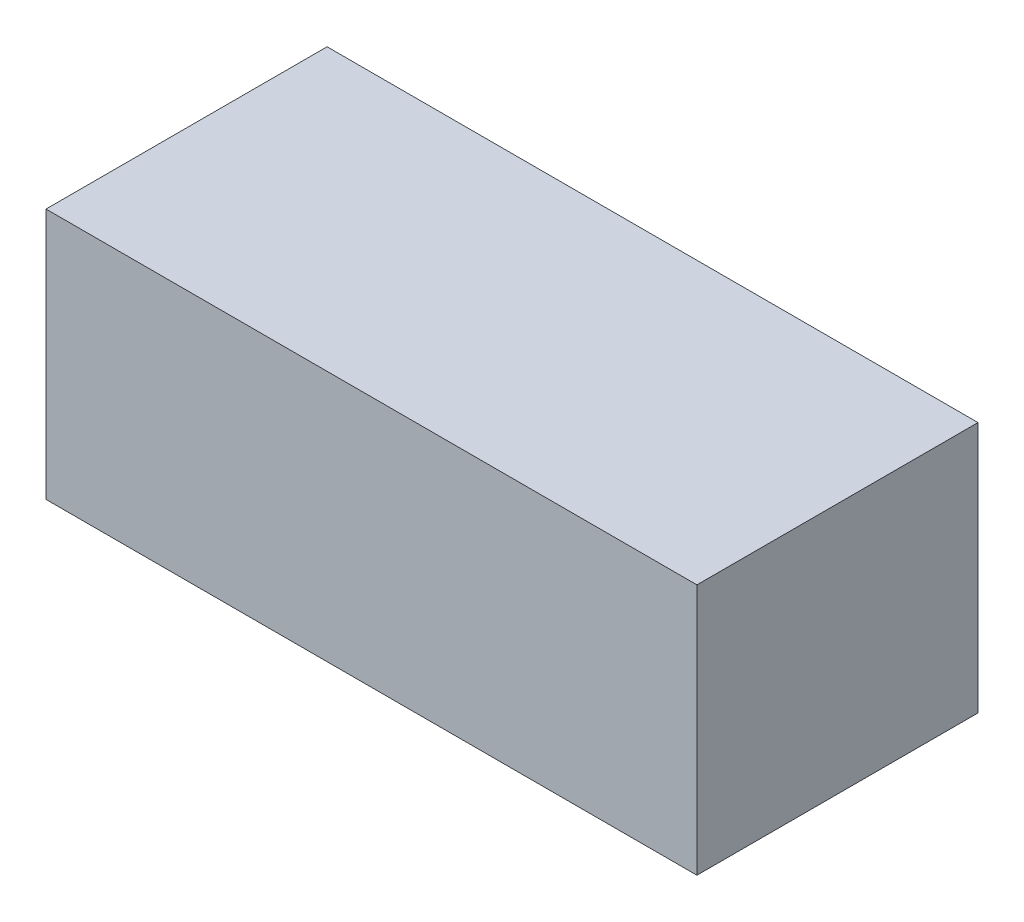
ISO-10303-21;
HEADER;
FILE_DESCRIPTION(('STEP AP214'),'2;1');
FILE_NAME('part.step','',(''),(''),'','','');
FILE_SCHEMA(('AUTOMOTIVE_DESIGN { 1 0 10303 214 1 1 1 1 }'));
ENDSEC;
DATA;
#1=APPLICATION_CONTEXT('core data for automotive mechanical design processes');
#2=APPLICATION_PROTOCOL_DEFINITION('international standard','automotive_design',2000,#1);
#3=PRODUCT_CONTEXT('',#1,'mechanical');
#4=PRODUCT('Part','Part','',(#3));
#5=PRODUCT_RELATED_PRODUCT_CATEGORY('part','',(#4));
#6=PRODUCT_DEFINITION_FORMATION('','',#4);
#7=PRODUCT_DEFINITION_CONTEXT('part definition',#1,'design');
#8=PRODUCT_DEFINITION('design','',#6,#7);
#9=PRODUCT_DEFINITION_SHAPE('','',#8);
#10=(LENGTH_UNIT() NAMED_UNIT(*) SI_UNIT(.MILLI.,.METRE.));
#11=(NAMED_UNIT(*) PLANE_ANGLE_UNIT() SI_UNIT($,.RADIAN.));
#12=(NAMED_UNIT(*) SI_UNIT($,.STERADIAN.) SOLID_ANGLE_UNIT());
#13=UNCERTAINTY_MEASURE_WITH_UNIT(LENGTH_MEASURE(1.E-05),#10,'distance_accuracy_value','');
#14=(GEOMETRIC_REPRESENTATION_CONTEXT(3) GLOBAL_UNCERTAINTY_ASSIGNED_CONTEXT((#13)) GLOBAL_UNIT_ASSIGNED_CONTEXT((#10,
#11,#12)) REPRESENTATION_CONTEXT('',''));
#15=CARTESIAN_POINT('',(0.,0.,0.));
#16=DIRECTION('',(0.,0.,1.));
#17=DIRECTION('',(1.,0.,0.));
#18=AXIS2_PLACEMENT_3D('',#15,#16,#17);
#19=CARTESIAN_POINT('',(0.,1.7,0.));
#20=DIRECTION('',(1.,0.,0.));
#21=DIRECTION('',(0.,0.,-1.));
#22=AXIS2_PLACEMENT_3D('',#19,#20,#21);
#23=PLANE('',#22);
#24=DIRECTION('',(0.,0.,1.));
#25=VECTOR('',#24,1.);
#26=CARTESIAN_POINT('',(0.,0.,0.));
#27=LINE('',#26,#25);
#28=CARTESIAN_POINT('',(0.,0.,-1.9));
#29=VERTEX_POINT('',#28);
#30=CARTESIAN_POINT('',(0.,0.,0.));
#31=VERTEX_POINT('',#30);
#32=EDGE_CURVE('E95',#29,#31,#27,.T.);
#33=ORIENTED_EDGE('',*,*,#32,.T.);
#34=DIRECTION('',(0.,-1.,0.));
#35=VECTOR('',#34,1.);
#36=CARTESIAN_POINT('',(0.,1.7,0.));
#37=LINE('',#36,#35);
#38=CARTESIAN_POINT('',(0.,1.7,0.));
#39=VERTEX_POINT('',#38);
#40=EDGE_CURVE('E11',#39,#31,#37,.T.);
#41=ORIENTED_EDGE('',*,*,#40,.F.);
#42=DIRECTION('',(0.,0.,1.));
#43=VECTOR('',#42,1.);
#44=CARTESIAN_POINT('',(0.,1.7,0.));
#45=LINE('',#44,#43);
#46=CARTESIAN_POINT('',(0.,1.7,-1.9));
#47=VERTEX_POINT('',#46);
#48=EDGE_CURVE('E83',#47,#39,#45,.T.);
#49=ORIENTED_EDGE('',*,*,#48,.F.);
#50=DIRECTION('',(0.,-1.,0.));
#51=VECTOR('',#50,1.);
#52=CARTESIAN_POINT('',(0.,1.7,-1.9));
#53=LINE('',#52,#51);
#54=EDGE_CURVE('E91',#47,#29,#53,.T.);
#55=ORIENTED_EDGE('',*,*,#54,.T.);
#56=EDGE_LOOP('',(#33,#41,#49,#55));
#57=FACE_BOUND('',#56,.T.);
#58=ADVANCED_FACE('F32',(#57),#23,.F.);
#59=CARTESIAN_POINT('',(0.,1.7,0.));
#60=DIRECTION('',(0.,0.,-1.));
#61=DIRECTION('',(-1.,0.,0.));
#62=AXIS2_PLACEMENT_3D('',#59,#60,#61);
#63=PLANE('',#62);
#64=DIRECTION('',(1.,0.,0.));
#65=VECTOR('',#64,1.);
#66=CARTESIAN_POINT('',(0.,0.,0.));
#67=LINE('',#66,#65);
#68=CARTESIAN_POINT('',(4.4,0.,0.));
#69=VERTEX_POINT('',#68);
#70=EDGE_CURVE('E87',#31,#69,#67,.T.);
#71=ORIENTED_EDGE('',*,*,#70,.T.);
#72=DIRECTION('',(0.,-1.,0.));
#73=VECTOR('',#72,1.);
#74=CARTESIAN_POINT('',(4.4,1.7,0.));
#75=LINE('',#74,#73);
#76=CARTESIAN_POINT('',(4.4,1.7,0.));
#77=VERTEX_POINT('',#76);
#78=EDGE_CURVE('E40',#77,#69,#75,.T.);
#79=ORIENTED_EDGE('',*,*,#78,.F.);
#80=DIRECTION('',(1.,0.,0.));
#81=VECTOR('',#80,1.);
#82=CARTESIAN_POINT('',(0.,1.7,0.));
#83=LINE('',#82,#81);
#84=EDGE_CURVE('E78',#39,#77,#83,.T.);
#85=ORIENTED_EDGE('',*,*,#84,.F.);
#86=ORIENTED_EDGE('',*,*,#40,.T.);
#87=EDGE_LOOP('',(#71,#79,#85,#86));
#88=FACE_BOUND('',#87,.T.);
#89=ADVANCED_FACE('F86',(#88),#63,.F.);
#90=CARTESIAN_POINT('',(4.4,1.7,0.));
#91=DIRECTION('',(-1.,0.,0.));
#92=DIRECTION('',(0.,0.,1.));
#93=AXIS2_PLACEMENT_3D('',#90,#91,#92);
#94=PLANE('',#93);
#95=DIRECTION('',(0.,0.,-1.));
#96=VECTOR('',#95,1.);
#97=CARTESIAN_POINT('',(4.4,0.,0.));
#98=LINE('',#97,#96);
#99=CARTESIAN_POINT('',(4.4,0.,-1.9));
#100=VERTEX_POINT('',#99);
#101=EDGE_CURVE('E65',#69,#100,#98,.T.);
#102=ORIENTED_EDGE('',*,*,#101,.T.);
#103=DIRECTION('',(0.,-1.,0.));
#104=VECTOR('',#103,1.);
#105=CARTESIAN_POINT('',(4.4,1.7,-1.9));
#106=LINE('',#105,#104);
#107=CARTESIAN_POINT('',(4.4,1.7,-1.9));
#108=VERTEX_POINT('',#107);
#109=EDGE_CURVE('E88',#108,#100,#106,.T.);
#110=ORIENTED_EDGE('',*,*,#109,.F.);
#111=DIRECTION('',(0.,0.,-1.));
#112=VECTOR('',#111,1.);
#113=CARTESIAN_POINT('',(4.4,1.7,0.));
#114=LINE('',#113,#112);
#115=EDGE_CURVE('E81',#77,#108,#114,.T.);
#116=ORIENTED_EDGE('',*,*,#115,.F.);
#117=ORIENTED_EDGE('',*,*,#78,.T.);
#118=EDGE_LOOP('',(#102,#110,#116,#117));
#119=FACE_BOUND('',#118,.T.);
#120=ADVANCED_FACE('F89',(#119),#94,.F.);
#121=CARTESIAN_POINT('',(0.,1.7,-1.9));
#122=DIRECTION('',(0.,0.,1.));
#123=DIRECTION('',(1.,0.,0.));
#124=AXIS2_PLACEMENT_3D('',#121,#122,#123);
#125=PLANE('',#124);
#126=DIRECTION('',(-1.,0.,0.));
#127=VECTOR('',#126,1.);
#128=CARTESIAN_POINT('',(0.,0.,-1.9));
#129=LINE('',#128,#127);
#130=EDGE_CURVE('E71',#100,#29,#129,.T.);
#131=ORIENTED_EDGE('',*,*,#130,.T.);
#132=ORIENTED_EDGE('',*,*,#54,.F.);
#133=DIRECTION('',(-1.,0.,0.));
#134=VECTOR('',#133,1.);
#135=CARTESIAN_POINT('',(0.,1.7,-1.9));
#136=LINE('',#135,#134);
#137=EDGE_CURVE('E48',#108,#47,#136,.T.);
#138=ORIENTED_EDGE('',*,*,#137,.F.);
#139=ORIENTED_EDGE('',*,*,#109,.T.);
#140=EDGE_LOOP('',(#131,#132,#138,#139));
#141=FACE_BOUND('',#140,.T.);
#142=ADVANCED_FACE('F102',(#141),#125,.F.);
#143=CARTESIAN_POINT('',(0.,1.7,0.));
#144=DIRECTION('',(0.,-1.,0.));
#145=DIRECTION('',(0.,0.,-1.));
#146=AXIS2_PLACEMENT_3D('',#143,#144,#145);
#147=PLANE('',#146);
#148=ORIENTED_EDGE('',*,*,#48,.T.);
#149=ORIENTED_EDGE('',*,*,#84,.T.);
#150=ORIENTED_EDGE('',*,*,#115,.T.);
#151=ORIENTED_EDGE('',*,*,#137,.T.);
#152=EDGE_LOOP('',(#148,#149,#150,#151));
#153=FACE_BOUND('',#152,.T.);
#154=ADVANCED_FACE('F79',(#153),#147,.F.);
#155=CARTESIAN_POINT('',(0.,0.,0.));
#156=DIRECTION('',(0.,-1.,0.));
#157=DIRECTION('',(0.,0.,-1.));
#158=AXIS2_PLACEMENT_3D('',#155,#156,#157);
#159=PLANE('',#158);
#160=ORIENTED_EDGE('',*,*,#32,.F.);
#161=ORIENTED_EDGE('',*,*,#130,.F.);
#162=ORIENTED_EDGE('',*,*,#101,.F.);
#163=ORIENTED_EDGE('',*,*,#70,.F.);
#164=EDGE_LOOP('',(#160,#161,#162,#163));
#165=FACE_BOUND('',#164,.T.);
#166=ADVANCED_FACE('F105',(#165),#159,.T.);
#167=CLOSED_SHELL('',(#58,#89,#120,#142,#154,#166));
#168=MANIFOLD_SOLID_BREP('B2',#167);
#169=ADVANCED_BREP_SHAPE_REPRESENTATION('',(#18,#168),#14);
#170=SHAPE_DEFINITION_REPRESENTATION(#9,#169);
ENDSEC;
END-ISO-10303-21;
